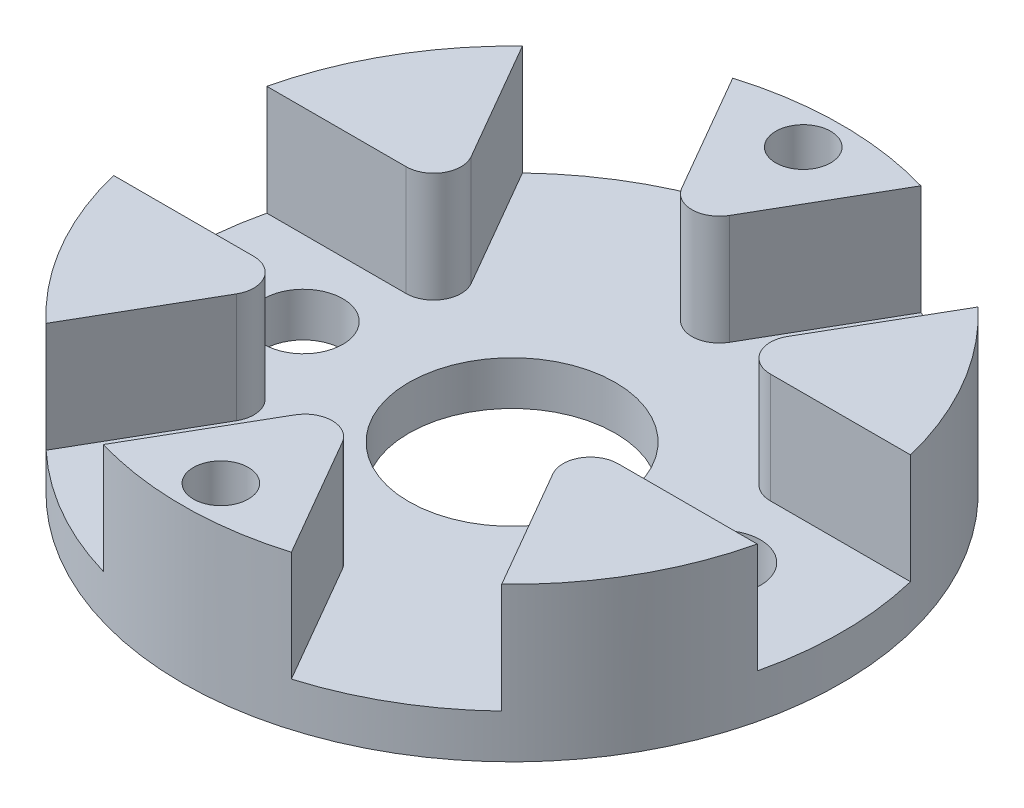
ISO-10303-21;
HEADER;
FILE_DESCRIPTION(('STEP AP214'),'2;1');
FILE_NAME('part.step','',(''),(''),'','','');
FILE_SCHEMA(('AUTOMOTIVE_DESIGN { 1 0 10303 214 1 1 1 1 }'));
ENDSEC;
DATA;
#1=APPLICATION_CONTEXT('core data for automotive mechanical design processes');
#2=APPLICATION_PROTOCOL_DEFINITION('international standard','automotive_design',2000,#1);
#3=PRODUCT_CONTEXT('',#1,'mechanical');
#4=PRODUCT('Part','Part','',(#3));
#5=PRODUCT_RELATED_PRODUCT_CATEGORY('part','',(#4));
#6=PRODUCT_DEFINITION_FORMATION('','',#4);
#7=PRODUCT_DEFINITION_CONTEXT('part definition',#1,'design');
#8=PRODUCT_DEFINITION('design','',#6,#7);
#9=PRODUCT_DEFINITION_SHAPE('','',#8);
#10=(LENGTH_UNIT() NAMED_UNIT(*) SI_UNIT(.MILLI.,.METRE.));
#11=(NAMED_UNIT(*) PLANE_ANGLE_UNIT() SI_UNIT($,.RADIAN.));
#12=(NAMED_UNIT(*) SI_UNIT($,.STERADIAN.) SOLID_ANGLE_UNIT());
#13=UNCERTAINTY_MEASURE_WITH_UNIT(LENGTH_MEASURE(1.E-05),#10,'distance_accuracy_value','');
#14=(GEOMETRIC_REPRESENTATION_CONTEXT(3) GLOBAL_UNCERTAINTY_ASSIGNED_CONTEXT((#13)) GLOBAL_UNIT_ASSIGNED_CONTEXT((#10,
#11,#12)) REPRESENTATION_CONTEXT('',''));
#15=CARTESIAN_POINT('',(0.,0.,0.));
#16=DIRECTION('',(0.,0.,1.));
#17=DIRECTION('',(1.,0.,0.));
#18=AXIS2_PLACEMENT_3D('',#15,#16,#17);
#19=CARTESIAN_POINT('',(0.,2.,0.));
#20=DIRECTION('',(0.,1.,0.));
#21=DIRECTION('',(0.,0.,1.));
#22=AXIS2_PLACEMENT_3D('',#19,#20,#21);
#23=PLANE('',#22);
#24=CARTESIAN_POINT('',(9.5,2.,0.));
#25=DIRECTION('',(0.,1.,0.));
#26=DIRECTION('',(0.,0.,1.));
#27=AXIS2_PLACEMENT_3D('',#24,#25,#26);
#28=CIRCLE('',#27,1.8);
#29=CARTESIAN_POINT('',(9.5,2.,1.8));
#30=VERTEX_POINT('',#29);
#31=EDGE_CURVE('E792',#30,#30,#28,.T.);
#32=ORIENTED_EDGE('',*,*,#31,.F.);
#33=EDGE_LOOP('',(#32));
#34=FACE_BOUND('',#33,.T.);
#35=CARTESIAN_POINT('',(-9.5,2.,0.));
#36=DIRECTION('',(0.,1.,0.));
#37=DIRECTION('',(0.,0.,1.));
#38=AXIS2_PLACEMENT_3D('',#35,#36,#37);
#39=CIRCLE('',#38,1.8);
#40=CARTESIAN_POINT('',(-9.5,2.,1.8));
#41=VERTEX_POINT('',#40);
#42=EDGE_CURVE('E782',#41,#41,#39,.T.);
#43=ORIENTED_EDGE('',*,*,#42,.F.);
#44=EDGE_LOOP('',(#43));
#45=FACE_BOUND('',#44,.T.);
#46=CARTESIAN_POINT('',(0.,2.,0.));
#47=DIRECTION('',(0.,1.,0.));
#48=DIRECTION('',(0.,0.,1.));
#49=AXIS2_PLACEMENT_3D('',#46,#47,#48);
#50=CIRCLE('',#49,4.7);
#51=CARTESIAN_POINT('',(0.,2.,4.7));
#52=VERTEX_POINT('',#51);
#53=EDGE_CURVE('E312',#52,#52,#50,.T.);
#54=ORIENTED_EDGE('',*,*,#53,.F.);
#55=EDGE_LOOP('',(#54));
#56=FACE_BOUND('',#55,.T.);
#57=DIRECTION('',(-0.500234443058651,0.,-0.865890005703843));
#58=VECTOR('',#57,1.);
#59=CARTESIAN_POINT('',(-6.09530314813485,2.,-3.44198772983538));
#60=LINE('',#59,#58);
#61=CARTESIAN_POINT('',(-7.17834248697673,2.,-5.31669458439183));
#62=VERTEX_POINT('',#61);
#63=CARTESIAN_POINT('',(-10.3687672084349,2.,-10.8392189099254));
#64=VERTEX_POINT('',#63);
#65=EDGE_CURVE('E210',#62,#64,#60,.T.);
#66=ORIENTED_EDGE('',*,*,#65,.F.);
#67=CARTESIAN_POINT('',(-8.26070499410654,2.,-4.69140153056852));
#68=DIRECTION('',(0.,1.,0.));
#69=DIRECTION('',(0.,0.,1.));
#70=AXIS2_PLACEMENT_3D('',#67,#68,#69);
#71=CIRCLE('',#70,1.25);
#72=CARTESIAN_POINT('',(-8.2603665782505,2.,-3.44140157637864));
#73=VERTEX_POINT('',#72);
#74=EDGE_CURVE('E331',#62,#73,#71,.F.);
#75=ORIENTED_EDGE('',*,*,#74,.T.);
#76=DIRECTION('',(0.999999963351906,0.,-0.000270732684830262));
#77=VECTOR('',#76,1.);
#78=CARTESIAN_POINT('',(-14.6002933553595,2.,-3.43968515091774));
#79=LINE('',#78,#77);
#80=CARTESIAN_POINT('',(-14.6002933553595,2.,-3.43968515091774));
#81=VERTEX_POINT('',#80);
#82=EDGE_CURVE('E225',#81,#73,#79,.T.);
#83=ORIENTED_EDGE('',*,*,#82,.F.);
#84=CARTESIAN_POINT('',(0.,2.,0.));
#85=DIRECTION('',(0.,1.,0.));
#86=DIRECTION('',(0.,0.,1.));
#87=AXIS2_PLACEMENT_3D('',#84,#85,#86);
#88=CIRCLE('',#87,15.);
#89=CARTESIAN_POINT('',(-14.5714225373935,2.,3.56000635346902));
#90=VERTEX_POINT('',#89);
#91=EDGE_CURVE('E377',#81,#90,#88,.T.);
#92=ORIENTED_EDGE('',*,*,#91,.T.);
#93=DIRECTION('',(-0.999999963351906,0.,0.000270732684829872));
#94=VECTOR('',#93,1.);
#95=CARTESIAN_POINT('',(-6.0285003876192,2.,3.55769350513435));
#96=LINE('',#95,#94);
#97=CARTESIAN_POINT('',(-8.19356381773485,2.,3.5582796585911));
#98=VERTEX_POINT('',#97);
#99=EDGE_CURVE('E234',#98,#90,#96,.T.);
#100=ORIENTED_EDGE('',*,*,#99,.F.);
#101=CARTESIAN_POINT('',(-8.19322540187881,2.,4.80827961278098));
#102=DIRECTION('',(0.,1.,0.));
#103=DIRECTION('',(0.,0.,1.));
#104=AXIS2_PLACEMENT_3D('',#101,#102,#103);
#105=CIRCLE('',#104,1.25);
#106=CARTESIAN_POINT('',(-7.11052447889297,2.,5.43298651314755));
#107=VERTEX_POINT('',#106);
#108=EDGE_CURVE('E329',#98,#107,#105,.F.);
#109=ORIENTED_EDGE('',*,*,#108,.T.);
#110=DIRECTION('',(0.499765520293255,0.,-0.866160738388673));
#111=VECTOR('',#110,1.);
#112=CARTESIAN_POINT('',(-10.2790013993946,2.,10.9243823729876));
#113=LINE('',#112,#111);
#114=CARTESIAN_POINT('',(-10.2790013993946,2.,10.9243823729876));
#115=VERTEX_POINT('',#114);
#116=EDGE_CURVE('E214',#115,#107,#113,.T.);
#117=ORIENTED_EDGE('',*,*,#116,.F.);
#118=CARTESIAN_POINT('',(-4.20265532895859,2.,14.3992252633944));
#119=VERTEX_POINT('',#118);
#120=EDGE_CURVE('E381',#115,#119,#88,.T.);
#121=ORIENTED_EDGE('',*,*,#120,.T.);
#122=DIRECTION('',(-0.499765520293255,0.,0.866160738388674));
#123=VECTOR('',#122,1.);
#124=CARTESIAN_POINT('',(0.0668027605156505,2.,6.99968123496974));
#125=LINE('',#124,#123);
#126=CARTESIAN_POINT('',(-1.01522133075812,2.,8.87497424298294));
#127=VERTEX_POINT('',#126);
#128=EDGE_CURVE('E252',#127,#119,#125,.T.);
#129=ORIENTED_EDGE('',*,*,#128,.F.);
#130=CARTESIAN_POINT('',(0.0674795922277266,2.,9.49968114334951));
#131=DIRECTION('',(0.,1.,0.));
#132=DIRECTION('',(0.,0.,1.));
#133=AXIS2_PLACEMENT_3D('',#130,#131,#132);
#134=CIRCLE('',#133,1.25);
#135=CARTESIAN_POINT('',(1.14984209935753,2.,8.8743880895262));
#136=VERTEX_POINT('',#135);
#137=EDGE_CURVE('E327',#127,#136,#134,.F.);
#138=ORIENTED_EDGE('',*,*,#137,.T.);
#139=DIRECTION('',(-0.50023444305865,0.,-0.865890005703843));
#140=VECTOR('',#139,1.);
#141=CARTESIAN_POINT('',(4.32129195596489,2.,14.3640675239054));
#142=LINE('',#141,#140);
#143=CARTESIAN_POINT('',(4.32129195596488,2.,14.3640675239054));
#144=VERTEX_POINT('',#143);
#145=EDGE_CURVE('E247',#144,#136,#142,.T.);
#146=ORIENTED_EDGE('',*,*,#145,.F.);
#147=CARTESIAN_POINT('',(10.3687672084349,2.,10.8392189099254));
#148=VERTEX_POINT('',#147);
#149=EDGE_CURVE('E398',#144,#148,#88,.T.);
#150=ORIENTED_EDGE('',*,*,#149,.T.);
#151=DIRECTION('',(0.50023444305865,0.,0.865890005703844));
#152=VECTOR('',#151,1.);
#153=CARTESIAN_POINT('',(6.09530314813485,2.,3.44198772983539));
#154=LINE('',#153,#152);
#155=CARTESIAN_POINT('',(7.17834248697673,2.,5.31669458439184));
#156=VERTEX_POINT('',#155);
#157=EDGE_CURVE('E270',#156,#148,#154,.T.);
#158=ORIENTED_EDGE('',*,*,#157,.F.);
#159=CARTESIAN_POINT('',(8.26070499410654,2.,4.69140153056853));
#160=DIRECTION('',(0.,1.,0.));
#161=DIRECTION('',(0.,0.,1.));
#162=AXIS2_PLACEMENT_3D('',#159,#160,#161);
#163=CIRCLE('',#162,1.25);
#164=CARTESIAN_POINT('',(8.2603665782505,2.,3.44140157637864));
#165=VERTEX_POINT('',#164);
#166=EDGE_CURVE('E325',#156,#165,#163,.F.);
#167=ORIENTED_EDGE('',*,*,#166,.T.);
#168=DIRECTION('',(-0.999999963351906,0.,0.000270732684829701));
#169=VECTOR('',#168,1.);
#170=CARTESIAN_POINT('',(14.6002933553595,2.,3.43968515091775));
#171=LINE('',#170,#169);
#172=CARTESIAN_POINT('',(14.6002933553595,2.,3.43968515091775));
#173=VERTEX_POINT('',#172);
#174=EDGE_CURVE('E265',#173,#165,#171,.T.);
#175=ORIENTED_EDGE('',*,*,#174,.F.);
#176=CARTESIAN_POINT('',(14.5714225373935,2.,-3.56000635346901));
#177=VERTEX_POINT('',#176);
#178=EDGE_CURVE('E397',#173,#177,#88,.T.);
#179=ORIENTED_EDGE('',*,*,#178,.T.);
#180=DIRECTION('',(0.999999963351906,0.,-0.000270732684829466));
#181=VECTOR('',#180,1.);
#182=CARTESIAN_POINT('',(6.0285003876192,2.,-3.55769350513435));
#183=LINE('',#182,#181);
#184=CARTESIAN_POINT('',(8.19356381773485,2.,-3.5582796585911));
#185=VERTEX_POINT('',#184);
#186=EDGE_CURVE('E288',#185,#177,#183,.T.);
#187=ORIENTED_EDGE('',*,*,#186,.F.);
#188=CARTESIAN_POINT('',(8.19322540187881,2.,-4.80827961278098));
#189=DIRECTION('',(0.,1.,0.));
#190=DIRECTION('',(0.,0.,1.));
#191=AXIS2_PLACEMENT_3D('',#188,#189,#190);
#192=CIRCLE('',#191,1.25);
#193=CARTESIAN_POINT('',(7.11052447889297,2.,-5.43298651314755));
#194=VERTEX_POINT('',#193);
#195=EDGE_CURVE('E41',#185,#194,#192,.F.);
#196=ORIENTED_EDGE('',*,*,#195,.T.);
#197=DIRECTION('',(-0.499765520293256,0.,0.866160738388673));
#198=VECTOR('',#197,1.);
#199=CARTESIAN_POINT('',(10.2790013993947,2.,-10.9243823729876));
#200=LINE('',#199,#198);
#201=CARTESIAN_POINT('',(10.2790013993947,2.,-10.9243823729876));
#202=VERTEX_POINT('',#201);
#203=EDGE_CURVE('E283',#202,#194,#200,.T.);
#204=ORIENTED_EDGE('',*,*,#203,.F.);
#205=CARTESIAN_POINT('',(4.2026553289586,2.,-14.3992252633944));
#206=VERTEX_POINT('',#205);
#207=EDGE_CURVE('E393',#202,#206,#88,.T.);
#208=ORIENTED_EDGE('',*,*,#207,.T.);
#209=DIRECTION('',(0.499765520293256,0.,-0.866160738388673));
#210=VECTOR('',#209,1.);
#211=CARTESIAN_POINT('',(-0.0668027605156504,2.,-6.99968123496974));
#212=LINE('',#211,#210);
#213=CARTESIAN_POINT('',(1.01522133075812,2.,-8.87497424298293));
#214=VERTEX_POINT('',#213);
#215=EDGE_CURVE('E305',#214,#206,#212,.T.);
#216=ORIENTED_EDGE('',*,*,#215,.F.);
#217=CARTESIAN_POINT('',(-0.0674795922277244,2.,-9.4996811433495));
#218=DIRECTION('',(0.,1.,0.));
#219=DIRECTION('',(0.,0.,1.));
#220=AXIS2_PLACEMENT_3D('',#217,#218,#219);
#221=CIRCLE('',#220,1.25);
#222=CARTESIAN_POINT('',(-1.14984209935753,2.,-8.87438808952619));
#223=VERTEX_POINT('',#222);
#224=EDGE_CURVE('E11',#214,#223,#221,.F.);
#225=ORIENTED_EDGE('',*,*,#224,.T.);
#226=DIRECTION('',(0.50023444305865,0.,0.865890005703844));
#227=VECTOR('',#226,1.);
#228=CARTESIAN_POINT('',(-4.32129195596488,2.,-14.3640675239054));
#229=LINE('',#228,#227);
#230=CARTESIAN_POINT('',(-4.32129195596488,2.,-14.3640675239054));
#231=VERTEX_POINT('',#230);
#232=EDGE_CURVE('E301',#231,#223,#229,.T.);
#233=ORIENTED_EDGE('',*,*,#232,.F.);
#234=EDGE_CURVE('E376',#231,#64,#88,.T.);
#235=ORIENTED_EDGE('',*,*,#234,.T.);
#236=EDGE_LOOP('',(#66,#75,#83,#92,#100,#109,#117,#121,#129,#138,#146,#150,#158,#167,#175,#179,
#187,#196,#204,#208,#216,#225,#233,#235));
#237=FACE_BOUND('',#236,.T.);
#238=ADVANCED_FACE('F33',(#34,#45,#56,#237),#23,.T.);
#239=CARTESIAN_POINT('',(0.,0.,0.));
#240=DIRECTION('',(0.,1.,0.));
#241=DIRECTION('',(0.,0.,1.));
#242=AXIS2_PLACEMENT_3D('',#239,#240,#241);
#243=PLANE('',#242);
#244=CARTESIAN_POINT('',(0.,0.,13.25));
#245=DIRECTION('',(0.,1.,0.));
#246=DIRECTION('',(0.,0.,1.));
#247=AXIS2_PLACEMENT_3D('',#244,#245,#246);
#248=CIRCLE('',#247,1.25);
#249=CARTESIAN_POINT('',(0.,0.,14.5));
#250=VERTEX_POINT('',#249);
#251=EDGE_CURVE('E799',#250,#250,#248,.T.);
#252=ORIENTED_EDGE('',*,*,#251,.T.);
#253=EDGE_LOOP('',(#252));
#254=FACE_BOUND('',#253,.T.);
#255=CARTESIAN_POINT('',(0.,0.,-13.25));
#256=DIRECTION('',(0.,1.,0.));
#257=DIRECTION('',(0.,0.,1.));
#258=AXIS2_PLACEMENT_3D('',#255,#256,#257);
#259=CIRCLE('',#258,1.25);
#260=CARTESIAN_POINT('',(0.,0.,-12.));
#261=VERTEX_POINT('',#260);
#262=EDGE_CURVE('E795',#261,#261,#259,.T.);
#263=ORIENTED_EDGE('',*,*,#262,.T.);
#264=EDGE_LOOP('',(#263));
#265=FACE_BOUND('',#264,.T.);
#266=CARTESIAN_POINT('',(9.5,0.,0.));
#267=DIRECTION('',(0.,1.,0.));
#268=DIRECTION('',(0.,0.,1.));
#269=AXIS2_PLACEMENT_3D('',#266,#267,#268);
#270=CIRCLE('',#269,1.8);
#271=CARTESIAN_POINT('',(9.5,0.,1.8));
#272=VERTEX_POINT('',#271);
#273=EDGE_CURVE('E787',#272,#272,#270,.F.);
#274=ORIENTED_EDGE('',*,*,#273,.F.);
#275=EDGE_LOOP('',(#274));
#276=FACE_BOUND('',#275,.T.);
#277=CARTESIAN_POINT('',(-9.5,0.,0.));
#278=DIRECTION('',(0.,1.,0.));
#279=DIRECTION('',(0.,0.,1.));
#280=AXIS2_PLACEMENT_3D('',#277,#278,#279);
#281=CIRCLE('',#280,1.8);
#282=CARTESIAN_POINT('',(-9.5,0.,1.8));
#283=VERTEX_POINT('',#282);
#284=EDGE_CURVE('E228',#283,#283,#281,.F.);
#285=ORIENTED_EDGE('',*,*,#284,.F.);
#286=EDGE_LOOP('',(#285));
#287=FACE_BOUND('',#286,.T.);
#288=CARTESIAN_POINT('',(0.,0.,0.));
#289=DIRECTION('',(0.,1.,0.));
#290=DIRECTION('',(0.,0.,1.));
#291=AXIS2_PLACEMENT_3D('',#288,#289,#290);
#292=CIRCLE('',#291,15.);
#293=CARTESIAN_POINT('',(0.,0.,15.));
#294=VERTEX_POINT('',#293);
#295=EDGE_CURVE('E386',#294,#294,#292,.T.);
#296=ORIENTED_EDGE('',*,*,#295,.F.);
#297=EDGE_LOOP('',(#296));
#298=FACE_BOUND('',#297,.T.);
#299=CARTESIAN_POINT('',(0.,0.,0.));
#300=DIRECTION('',(0.,1.,0.));
#301=DIRECTION('',(0.,0.,1.));
#302=AXIS2_PLACEMENT_3D('',#299,#300,#301);
#303=CIRCLE('',#302,4.7);
#304=CARTESIAN_POINT('',(0.,0.,4.7));
#305=VERTEX_POINT('',#304);
#306=EDGE_CURVE('E408',#305,#305,#303,.T.);
#307=ORIENTED_EDGE('',*,*,#306,.T.);
#308=EDGE_LOOP('',(#307));
#309=FACE_BOUND('',#308,.T.);
#310=ADVANCED_FACE('F452',(#254,#265,#276,#287,#298,#309),#243,.F.);
#311=CARTESIAN_POINT('',(0.,2.,0.));
#312=DIRECTION('',(0.,-1.,0.));
#313=DIRECTION('',(0.,0.,-1.));
#314=AXIS2_PLACEMENT_3D('',#311,#312,#313);
#315=CYLINDRICAL_SURFACE('',#314,15.);
#316=ORIENTED_EDGE('',*,*,#234,.F.);
#317=DIRECTION('',(0.,-1.,0.));
#318=VECTOR('',#317,1.);
#319=CARTESIAN_POINT('',(-4.32129195596489,7.,-14.3640675239054));
#320=LINE('',#319,#318);
#321=CARTESIAN_POINT('',(-4.32129195596489,7.,-14.3640675239054));
#322=VERTEX_POINT('',#321);
#323=EDGE_CURVE('E309',#322,#231,#320,.T.);
#324=ORIENTED_EDGE('',*,*,#323,.F.);
#325=CARTESIAN_POINT('',(0.,7.,0.));
#326=DIRECTION('',(0.,1.,0.));
#327=DIRECTION('',(0.,0.,-1.));
#328=AXIS2_PLACEMENT_3D('',#325,#326,#327);
#329=CIRCLE('',#328,15.);
#330=CARTESIAN_POINT('',(4.2026553289586,7.,-14.3992252633944));
#331=VERTEX_POINT('',#330);
#332=EDGE_CURVE('E307',#331,#322,#329,.T.);
#333=ORIENTED_EDGE('',*,*,#332,.F.);
#334=DIRECTION('',(0.,-1.,0.));
#335=VECTOR('',#334,1.);
#336=CARTESIAN_POINT('',(4.2026553289586,7.,-14.3992252633944));
#337=LINE('',#336,#335);
#338=EDGE_CURVE('E412',#331,#206,#337,.T.);
#339=ORIENTED_EDGE('',*,*,#338,.T.);
#340=ORIENTED_EDGE('',*,*,#207,.F.);
#341=DIRECTION('',(0.,-1.,0.));
#342=VECTOR('',#341,1.);
#343=CARTESIAN_POINT('',(10.2790013993947,7.,-10.9243823729876));
#344=LINE('',#343,#342);
#345=CARTESIAN_POINT('',(10.2790013993947,7.,-10.9243823729876));
#346=VERTEX_POINT('',#345);
#347=EDGE_CURVE('E292',#346,#202,#344,.T.);
#348=ORIENTED_EDGE('',*,*,#347,.F.);
#349=CARTESIAN_POINT('',(0.,7.,0.));
#350=DIRECTION('',(0.,1.,0.));
#351=DIRECTION('',(0.,0.,-1.));
#352=AXIS2_PLACEMENT_3D('',#349,#350,#351);
#353=CIRCLE('',#352,15.);
#354=CARTESIAN_POINT('',(14.5714225373935,7.,-3.56000635346901));
#355=VERTEX_POINT('',#354);
#356=EDGE_CURVE('E290',#355,#346,#353,.T.);
#357=ORIENTED_EDGE('',*,*,#356,.F.);
#358=DIRECTION('',(0.,-1.,0.));
#359=VECTOR('',#358,1.);
#360=CARTESIAN_POINT('',(14.5714225373935,7.,-3.56000635346901));
#361=LINE('',#360,#359);
#362=EDGE_CURVE('E298',#355,#177,#361,.T.);
#363=ORIENTED_EDGE('',*,*,#362,.T.);
#364=ORIENTED_EDGE('',*,*,#178,.F.);
#365=DIRECTION('',(0.,-1.,0.));
#366=VECTOR('',#365,1.);
#367=CARTESIAN_POINT('',(14.6002933553595,7.,3.43968515091775));
#368=LINE('',#367,#366);
#369=CARTESIAN_POINT('',(14.6002933553595,7.,3.43968515091775));
#370=VERTEX_POINT('',#369);
#371=EDGE_CURVE('E274',#370,#173,#368,.T.);
#372=ORIENTED_EDGE('',*,*,#371,.F.);
#373=CARTESIAN_POINT('',(0.,7.,0.));
#374=DIRECTION('',(0.,1.,0.));
#375=DIRECTION('',(0.,0.,-1.));
#376=AXIS2_PLACEMENT_3D('',#373,#374,#375);
#377=CIRCLE('',#376,15.);
#378=CARTESIAN_POINT('',(10.3687672084349,7.,10.8392189099254));
#379=VERTEX_POINT('',#378);
#380=EDGE_CURVE('E272',#379,#370,#377,.T.);
#381=ORIENTED_EDGE('',*,*,#380,.F.);
#382=DIRECTION('',(0.,-1.,0.));
#383=VECTOR('',#382,1.);
#384=CARTESIAN_POINT('',(10.3687672084349,7.,10.8392189099254));
#385=LINE('',#384,#383);
#386=EDGE_CURVE('E280',#379,#148,#385,.T.);
#387=ORIENTED_EDGE('',*,*,#386,.T.);
#388=ORIENTED_EDGE('',*,*,#149,.F.);
#389=DIRECTION('',(0.,-1.,0.));
#390=VECTOR('',#389,1.);
#391=CARTESIAN_POINT('',(4.32129195596488,7.,14.3640675239054));
#392=LINE('',#391,#390);
#393=CARTESIAN_POINT('',(4.32129195596488,7.,14.3640675239054));
#394=VERTEX_POINT('',#393);
#395=EDGE_CURVE('E256',#394,#144,#392,.T.);
#396=ORIENTED_EDGE('',*,*,#395,.F.);
#397=CARTESIAN_POINT('',(0.,7.,0.));
#398=DIRECTION('',(0.,1.,0.));
#399=DIRECTION('',(0.,0.,-1.));
#400=AXIS2_PLACEMENT_3D('',#397,#398,#399);
#401=CIRCLE('',#400,15.);
#402=CARTESIAN_POINT('',(-4.20265532895859,7.,14.3992252633944));
#403=VERTEX_POINT('',#402);
#404=EDGE_CURVE('E254',#403,#394,#401,.T.);
#405=ORIENTED_EDGE('',*,*,#404,.F.);
#406=DIRECTION('',(0.,-1.,0.));
#407=VECTOR('',#406,1.);
#408=CARTESIAN_POINT('',(-4.20265532895859,7.,14.3992252633944));
#409=LINE('',#408,#407);
#410=EDGE_CURVE('E262',#403,#119,#409,.T.);
#411=ORIENTED_EDGE('',*,*,#410,.T.);
#412=ORIENTED_EDGE('',*,*,#120,.F.);
#413=DIRECTION('',(0.,-1.,0.));
#414=VECTOR('',#413,1.);
#415=CARTESIAN_POINT('',(-10.2790013993946,7.,10.9243823729876));
#416=LINE('',#415,#414);
#417=CARTESIAN_POINT('',(-10.2790013993946,7.,10.9243823729876));
#418=VERTEX_POINT('',#417);
#419=EDGE_CURVE('E238',#418,#115,#416,.T.);
#420=ORIENTED_EDGE('',*,*,#419,.F.);
#421=CARTESIAN_POINT('',(0.,7.,0.));
#422=DIRECTION('',(0.,1.,0.));
#423=DIRECTION('',(0.,0.,-1.));
#424=AXIS2_PLACEMENT_3D('',#421,#422,#423);
#425=CIRCLE('',#424,15.);
#426=CARTESIAN_POINT('',(-14.5714225373935,7.,3.56000635346902));
#427=VERTEX_POINT('',#426);
#428=EDGE_CURVE('E236',#427,#418,#425,.T.);
#429=ORIENTED_EDGE('',*,*,#428,.F.);
#430=DIRECTION('',(0.,-1.,0.));
#431=VECTOR('',#430,1.);
#432=CARTESIAN_POINT('',(-14.5714225373935,7.,3.56000635346902));
#433=LINE('',#432,#431);
#434=EDGE_CURVE('E244',#427,#90,#433,.T.);
#435=ORIENTED_EDGE('',*,*,#434,.T.);
#436=ORIENTED_EDGE('',*,*,#91,.F.);
#437=DIRECTION('',(0.,-1.,0.));
#438=VECTOR('',#437,1.);
#439=CARTESIAN_POINT('',(-14.6002933553595,7.,-3.43968515091774));
#440=LINE('',#439,#438);
#441=CARTESIAN_POINT('',(-14.6002933553595,7.,-3.43968515091774));
#442=VERTEX_POINT('',#441);
#443=EDGE_CURVE('E215',#442,#81,#440,.T.);
#444=ORIENTED_EDGE('',*,*,#443,.F.);
#445=CARTESIAN_POINT('',(0.,7.,0.));
#446=DIRECTION('',(0.,1.,0.));
#447=DIRECTION('',(0.,0.,-1.));
#448=AXIS2_PLACEMENT_3D('',#445,#446,#447);
#449=CIRCLE('',#448,15.);
#450=CARTESIAN_POINT('',(-10.3687672084349,7.,-10.8392189099254));
#451=VERTEX_POINT('',#450);
#452=EDGE_CURVE('E197',#451,#442,#449,.T.);
#453=ORIENTED_EDGE('',*,*,#452,.F.);
#454=DIRECTION('',(0.,-1.,0.));
#455=VECTOR('',#454,1.);
#456=CARTESIAN_POINT('',(-10.3687672084349,7.,-10.8392189099254));
#457=LINE('',#456,#455);
#458=EDGE_CURVE('E207',#451,#64,#457,.T.);
#459=ORIENTED_EDGE('',*,*,#458,.T.);
#460=EDGE_LOOP('',(#316,#324,#333,#339,#340,#348,#357,#363,#364,#372,#381,#387,#388,#396,#405,
#411,#412,#420,#429,#435,#436,#444,#453,#459));
#461=FACE_BOUND('',#460,.T.);
#462=ORIENTED_EDGE('',*,*,#295,.T.);
#463=EDGE_LOOP('',(#462));
#464=FACE_BOUND('',#463,.T.);
#465=ADVANCED_FACE('F217',(#461,#464),#315,.T.);
#466=CARTESIAN_POINT('',(0.,2.,0.));
#467=DIRECTION('',(0.,-1.,0.));
#468=DIRECTION('',(0.,0.,-1.));
#469=AXIS2_PLACEMENT_3D('',#466,#467,#468);
#470=CYLINDRICAL_SURFACE('',#469,4.7);
#471=ORIENTED_EDGE('',*,*,#53,.T.);
#472=EDGE_LOOP('',(#471));
#473=FACE_BOUND('',#472,.T.);
#474=ORIENTED_EDGE('',*,*,#306,.F.);
#475=EDGE_LOOP('',(#474));
#476=FACE_BOUND('',#475,.T.);
#477=ADVANCED_FACE('F463',(#473,#476),#470,.F.);
#478=CARTESIAN_POINT('',(-4.32129195596488,7.,-14.3640675239054));
#479=DIRECTION('',(0.865890005703844,0.,-0.50023444305865));
#480=DIRECTION('',(-0.50023444305865,0.,-0.865890005703844));
#481=AXIS2_PLACEMENT_3D('',#478,#479,#480);
#482=PLANE('',#481);
#483=ORIENTED_EDGE('',*,*,#232,.T.);
#484=DIRECTION('',(0.,-1.,0.));
#485=VECTOR('',#484,1.);
#486=CARTESIAN_POINT('',(-1.14984209935753,7.,-8.87438808952619));
#487=LINE('',#486,#485);
#488=CARTESIAN_POINT('',(-1.14984209935753,7.,-8.87438808952619));
#489=VERTEX_POINT('',#488);
#490=EDGE_CURVE('E48',#223,#489,#487,.F.);
#491=ORIENTED_EDGE('',*,*,#490,.T.);
#492=DIRECTION('',(0.50023444305865,0.,0.865890005703844));
#493=VECTOR('',#492,1.);
#494=CARTESIAN_POINT('',(-4.32129195596488,7.,-14.3640675239054));
#495=LINE('',#494,#493);
#496=EDGE_CURVE('E302',#322,#489,#495,.T.);
#497=ORIENTED_EDGE('',*,*,#496,.F.);
#498=ORIENTED_EDGE('',*,*,#323,.T.);
#499=EDGE_LOOP('',(#483,#491,#497,#498));
#500=FACE_BOUND('',#499,.T.);
#501=ADVANCED_FACE('F425',(#500),#482,.F.);
#502=CARTESIAN_POINT('',(-0.0668027605156504,7.,-6.99968123496974));
#503=DIRECTION('',(-0.866160738388673,0.,-0.499765520293256));
#504=DIRECTION('',(-0.499765520293256,0.,0.866160738388673));
#505=AXIS2_PLACEMENT_3D('',#502,#503,#504);
#506=PLANE('',#505);
#507=DIRECTION('',(0.499765520293256,0.,-0.866160738388673));
#508=VECTOR('',#507,1.);
#509=CARTESIAN_POINT('',(-0.0668027605156504,7.,-6.99968123496974));
#510=LINE('',#509,#508);
#511=CARTESIAN_POINT('',(1.01522133075812,7.,-8.87497424298293));
#512=VERTEX_POINT('',#511);
#513=EDGE_CURVE('E304',#512,#331,#510,.T.);
#514=ORIENTED_EDGE('',*,*,#513,.F.);
#515=DIRECTION('',(0.,-1.,0.));
#516=VECTOR('',#515,1.);
#517=CARTESIAN_POINT('',(1.01522133075812,7.,-8.87497424298293));
#518=LINE('',#517,#516);
#519=EDGE_CURVE('E319',#512,#214,#518,.T.);
#520=ORIENTED_EDGE('',*,*,#519,.T.);
#521=ORIENTED_EDGE('',*,*,#215,.T.);
#522=ORIENTED_EDGE('',*,*,#338,.F.);
#523=EDGE_LOOP('',(#514,#520,#521,#522));
#524=FACE_BOUND('',#523,.T.);
#525=ADVANCED_FACE('F434',(#524),#506,.F.);
#526=CARTESIAN_POINT('',(0.,7.,0.));
#527=DIRECTION('',(0.,-1.,0.));
#528=DIRECTION('',(0.,0.,-1.));
#529=AXIS2_PLACEMENT_3D('',#526,#527,#528);
#530=PLANE('',#529);
#531=CARTESIAN_POINT('',(0.,7.,-13.25));
#532=DIRECTION('',(0.,1.,0.));
#533=DIRECTION('',(0.,0.,1.));
#534=AXIS2_PLACEMENT_3D('',#531,#532,#533);
#535=CIRCLE('',#534,1.25);
#536=CARTESIAN_POINT('',(0.,7.,-12.));
#537=VERTEX_POINT('',#536);
#538=EDGE_CURVE('E796',#537,#537,#535,.T.);
#539=ORIENTED_EDGE('',*,*,#538,.F.);
#540=EDGE_LOOP('',(#539));
#541=FACE_BOUND('',#540,.T.);
#542=ORIENTED_EDGE('',*,*,#496,.T.);
#543=CARTESIAN_POINT('',(-0.0674795922277244,7.,-9.4996811433495));
#544=DIRECTION('',(0.,-1.,0.));
#545=DIRECTION('',(0.,0.,-1.));
#546=AXIS2_PLACEMENT_3D('',#543,#544,#545);
#547=CIRCLE('',#546,1.25);
#548=EDGE_CURVE('E323',#489,#512,#547,.F.);
#549=ORIENTED_EDGE('',*,*,#548,.T.);
#550=ORIENTED_EDGE('',*,*,#513,.T.);
#551=ORIENTED_EDGE('',*,*,#332,.T.);
#552=EDGE_LOOP('',(#542,#549,#550,#551));
#553=FACE_BOUND('',#552,.T.);
#554=ADVANCED_FACE('F432',(#541,#553),#530,.F.);
#555=CARTESIAN_POINT('',(10.2790013993947,7.,-10.9243823729876));
#556=DIRECTION('',(0.866160738388673,0.,0.499765520293256));
#557=DIRECTION('',(0.499765520293256,0.,-0.866160738388673));
#558=AXIS2_PLACEMENT_3D('',#555,#556,#557);
#559=PLANE('',#558);
#560=ORIENTED_EDGE('',*,*,#203,.T.);
#561=DIRECTION('',(0.,-1.,0.));
#562=VECTOR('',#561,1.);
#563=CARTESIAN_POINT('',(7.11052447889297,7.,-5.43298651314755));
#564=LINE('',#563,#562);
#565=CARTESIAN_POINT('',(7.11052447889297,7.,-5.43298651314755));
#566=VERTEX_POINT('',#565);
#567=EDGE_CURVE('E343',#194,#566,#564,.F.);
#568=ORIENTED_EDGE('',*,*,#567,.T.);
#569=DIRECTION('',(-0.499765520293256,0.,0.866160738388673));
#570=VECTOR('',#569,1.);
#571=CARTESIAN_POINT('',(10.2790013993947,7.,-10.9243823729876));
#572=LINE('',#571,#570);
#573=EDGE_CURVE('E284',#346,#566,#572,.T.);
#574=ORIENTED_EDGE('',*,*,#573,.F.);
#575=ORIENTED_EDGE('',*,*,#347,.T.);
#576=EDGE_LOOP('',(#560,#568,#574,#575));
#577=FACE_BOUND('',#576,.T.);
#578=ADVANCED_FACE('F341',(#577),#559,.F.);
#579=CARTESIAN_POINT('',(6.0285003876192,7.,-3.55769350513435));
#580=DIRECTION('',(-0.000270732684829466,0.,-0.999999963351906));
#581=DIRECTION('',(-0.999999963351906,0.,0.000270732684829466));
#582=AXIS2_PLACEMENT_3D('',#579,#580,#581);
#583=PLANE('',#582);
#584=DIRECTION('',(0.999999963351906,0.,-0.000270732684829466));
#585=VECTOR('',#584,1.);
#586=CARTESIAN_POINT('',(6.0285003876192,7.,-3.55769350513435));
#587=LINE('',#586,#585);
#588=CARTESIAN_POINT('',(8.19356381773485,7.,-3.5582796585911));
#589=VERTEX_POINT('',#588);
#590=EDGE_CURVE('E287',#589,#355,#587,.T.);
#591=ORIENTED_EDGE('',*,*,#590,.F.);
#592=DIRECTION('',(0.,-1.,0.));
#593=VECTOR('',#592,1.);
#594=CARTESIAN_POINT('',(8.19356381773485,7.,-3.5582796585911));
#595=LINE('',#594,#593);
#596=EDGE_CURVE('E347',#589,#185,#595,.T.);
#597=ORIENTED_EDGE('',*,*,#596,.T.);
#598=ORIENTED_EDGE('',*,*,#186,.T.);
#599=ORIENTED_EDGE('',*,*,#362,.F.);
#600=EDGE_LOOP('',(#591,#597,#598,#599));
#601=FACE_BOUND('',#600,.T.);
#602=ADVANCED_FACE('F539',(#601),#583,.F.);
#603=CARTESIAN_POINT('',(0.,7.,0.));
#604=DIRECTION('',(0.,-1.,0.));
#605=DIRECTION('',(0.,0.,-1.));
#606=AXIS2_PLACEMENT_3D('',#603,#604,#605);
#607=PLANE('',#606);
#608=ORIENTED_EDGE('',*,*,#573,.T.);
#609=CARTESIAN_POINT('',(8.19322540187881,7.,-4.80827961278098));
#610=DIRECTION('',(0.,-1.,0.));
#611=DIRECTION('',(0.,0.,-1.));
#612=AXIS2_PLACEMENT_3D('',#609,#610,#611);
#613=CIRCLE('',#612,1.25);
#614=EDGE_CURVE('E317',#566,#589,#613,.F.);
#615=ORIENTED_EDGE('',*,*,#614,.T.);
#616=ORIENTED_EDGE('',*,*,#590,.T.);
#617=ORIENTED_EDGE('',*,*,#356,.T.);
#618=EDGE_LOOP('',(#608,#615,#616,#617));
#619=FACE_BOUND('',#618,.T.);
#620=ADVANCED_FACE('F535',(#619),#607,.F.);
#621=CARTESIAN_POINT('',(14.6002933553595,7.,3.43968515091775));
#622=DIRECTION('',(0.000270732684829701,0.,0.999999963351906));
#623=DIRECTION('',(0.999999963351906,0.,-0.000270732684829701));
#624=AXIS2_PLACEMENT_3D('',#621,#622,#623);
#625=PLANE('',#624);
#626=ORIENTED_EDGE('',*,*,#174,.T.);
#627=DIRECTION('',(0.,-1.,0.));
#628=VECTOR('',#627,1.);
#629=CARTESIAN_POINT('',(8.2603665782505,7.,3.44140157637864));
#630=LINE('',#629,#628);
#631=CARTESIAN_POINT('',(8.2603665782505,7.,3.44140157637864));
#632=VERTEX_POINT('',#631);
#633=EDGE_CURVE('E371',#165,#632,#630,.F.);
#634=ORIENTED_EDGE('',*,*,#633,.T.);
#635=DIRECTION('',(-0.999999963351906,0.,0.000270732684829701));
#636=VECTOR('',#635,1.);
#637=CARTESIAN_POINT('',(14.6002933553595,7.,3.43968515091775));
#638=LINE('',#637,#636);
#639=EDGE_CURVE('E266',#370,#632,#638,.T.);
#640=ORIENTED_EDGE('',*,*,#639,.F.);
#641=ORIENTED_EDGE('',*,*,#371,.T.);
#642=EDGE_LOOP('',(#626,#634,#640,#641));
#643=FACE_BOUND('',#642,.T.);
#644=ADVANCED_FACE('F531',(#643),#625,.F.);
#645=CARTESIAN_POINT('',(6.09530314813485,7.,3.44198772983539));
#646=DIRECTION('',(0.865890005703844,0.,-0.50023444305865));
#647=DIRECTION('',(-0.50023444305865,0.,-0.865890005703844));
#648=AXIS2_PLACEMENT_3D('',#645,#646,#647);
#649=PLANE('',#648);
#650=DIRECTION('',(0.50023444305865,0.,0.865890005703844));
#651=VECTOR('',#650,1.);
#652=CARTESIAN_POINT('',(6.09530314813485,7.,3.44198772983539));
#653=LINE('',#652,#651);
#654=CARTESIAN_POINT('',(7.17834248697673,7.,5.31669458439184));
#655=VERTEX_POINT('',#654);
#656=EDGE_CURVE('E269',#655,#379,#653,.T.);
#657=ORIENTED_EDGE('',*,*,#656,.F.);
#658=DIRECTION('',(0.,-1.,0.));
#659=VECTOR('',#658,1.);
#660=CARTESIAN_POINT('',(7.17834248697673,7.,5.31669458439184));
#661=LINE('',#660,#659);
#662=EDGE_CURVE('E373',#655,#156,#661,.T.);
#663=ORIENTED_EDGE('',*,*,#662,.T.);
#664=ORIENTED_EDGE('',*,*,#157,.T.);
#665=ORIENTED_EDGE('',*,*,#386,.F.);
#666=EDGE_LOOP('',(#657,#663,#664,#665));
#667=FACE_BOUND('',#666,.T.);
#668=ADVANCED_FACE('F527',(#667),#649,.F.);
#669=CARTESIAN_POINT('',(0.,7.,0.));
#670=DIRECTION('',(0.,-1.,0.));
#671=DIRECTION('',(0.,0.,-1.));
#672=AXIS2_PLACEMENT_3D('',#669,#670,#671);
#673=PLANE('',#672);
#674=ORIENTED_EDGE('',*,*,#639,.T.);
#675=CARTESIAN_POINT('',(8.26070499410654,7.,4.69140153056853));
#676=DIRECTION('',(0.,-1.,0.));
#677=DIRECTION('',(0.,0.,-1.));
#678=AXIS2_PLACEMENT_3D('',#675,#676,#677);
#679=CIRCLE('',#678,1.25);
#680=EDGE_CURVE('E369',#632,#655,#679,.F.);
#681=ORIENTED_EDGE('',*,*,#680,.T.);
#682=ORIENTED_EDGE('',*,*,#656,.T.);
#683=ORIENTED_EDGE('',*,*,#380,.T.);
#684=EDGE_LOOP('',(#674,#681,#682,#683));
#685=FACE_BOUND('',#684,.T.);
#686=ADVANCED_FACE('F524',(#685),#673,.F.);
#687=CARTESIAN_POINT('',(4.32129195596489,7.,14.3640675239054));
#688=DIRECTION('',(-0.865890005703843,0.,0.50023444305865));
#689=DIRECTION('',(0.50023444305865,0.,0.865890005703843));
#690=AXIS2_PLACEMENT_3D('',#687,#688,#689);
#691=PLANE('',#690);
#692=ORIENTED_EDGE('',*,*,#145,.T.);
#693=DIRECTION('',(0.,-1.,0.));
#694=VECTOR('',#693,1.);
#695=CARTESIAN_POINT('',(1.14984209935753,7.,8.8743880895262));
#696=LINE('',#695,#694);
#697=CARTESIAN_POINT('',(1.14984209935753,7.,8.8743880895262));
#698=VERTEX_POINT('',#697);
#699=EDGE_CURVE('E364',#136,#698,#696,.F.);
#700=ORIENTED_EDGE('',*,*,#699,.T.);
#701=DIRECTION('',(-0.50023444305865,0.,-0.865890005703843));
#702=VECTOR('',#701,1.);
#703=CARTESIAN_POINT('',(4.32129195596489,7.,14.3640675239054));
#704=LINE('',#703,#702);
#705=EDGE_CURVE('E248',#394,#698,#704,.T.);
#706=ORIENTED_EDGE('',*,*,#705,.F.);
#707=ORIENTED_EDGE('',*,*,#395,.T.);
#708=EDGE_LOOP('',(#692,#700,#706,#707));
#709=FACE_BOUND('',#708,.T.);
#710=ADVANCED_FACE('F490',(#709),#691,.F.);
#711=CARTESIAN_POINT('',(0.0668027605156505,7.,6.99968123496974));
#712=DIRECTION('',(0.866160738388674,0.,0.499765520293255));
#713=DIRECTION('',(0.499765520293255,0.,-0.866160738388674));
#714=AXIS2_PLACEMENT_3D('',#711,#712,#713);
#715=PLANE('',#714);
#716=DIRECTION('',(-0.499765520293255,0.,0.866160738388674));
#717=VECTOR('',#716,1.);
#718=CARTESIAN_POINT('',(0.0668027605156505,7.,6.99968123496974));
#719=LINE('',#718,#717);
#720=CARTESIAN_POINT('',(-1.01522133075812,7.,8.87497424298294));
#721=VERTEX_POINT('',#720);
#722=EDGE_CURVE('E251',#721,#403,#719,.T.);
#723=ORIENTED_EDGE('',*,*,#722,.F.);
#724=DIRECTION('',(0.,-1.,0.));
#725=VECTOR('',#724,1.);
#726=CARTESIAN_POINT('',(-1.01522133075812,7.,8.87497424298294));
#727=LINE('',#726,#725);
#728=EDGE_CURVE('E366',#721,#127,#727,.T.);
#729=ORIENTED_EDGE('',*,*,#728,.T.);
#730=ORIENTED_EDGE('',*,*,#128,.T.);
#731=ORIENTED_EDGE('',*,*,#410,.F.);
#732=EDGE_LOOP('',(#723,#729,#730,#731));
#733=FACE_BOUND('',#732,.T.);
#734=ADVANCED_FACE('F485',(#733),#715,.F.);
#735=CARTESIAN_POINT('',(0.,7.,0.));
#736=DIRECTION('',(0.,-1.,0.));
#737=DIRECTION('',(0.,0.,-1.));
#738=AXIS2_PLACEMENT_3D('',#735,#736,#737);
#739=PLANE('',#738);
#740=CARTESIAN_POINT('',(0.,7.,13.25));
#741=DIRECTION('',(0.,1.,0.));
#742=DIRECTION('',(0.,0.,1.));
#743=AXIS2_PLACEMENT_3D('',#740,#741,#742);
#744=CIRCLE('',#743,1.25);
#745=CARTESIAN_POINT('',(0.,7.,14.5));
#746=VERTEX_POINT('',#745);
#747=EDGE_CURVE('E802',#746,#746,#744,.T.);
#748=ORIENTED_EDGE('',*,*,#747,.F.);
#749=EDGE_LOOP('',(#748));
#750=FACE_BOUND('',#749,.T.);
#751=ORIENTED_EDGE('',*,*,#705,.T.);
#752=CARTESIAN_POINT('',(0.0674795922277266,7.,9.49968114334951));
#753=DIRECTION('',(0.,-1.,0.));
#754=DIRECTION('',(0.,0.,-1.));
#755=AXIS2_PLACEMENT_3D('',#752,#753,#754);
#756=CIRCLE('',#755,1.25);
#757=EDGE_CURVE('E362',#698,#721,#756,.F.);
#758=ORIENTED_EDGE('',*,*,#757,.T.);
#759=ORIENTED_EDGE('',*,*,#722,.T.);
#760=ORIENTED_EDGE('',*,*,#404,.T.);
#761=EDGE_LOOP('',(#751,#758,#759,#760));
#762=FACE_BOUND('',#761,.T.);
#763=ADVANCED_FACE('F481',(#750,#762),#739,.F.);
#764=CARTESIAN_POINT('',(-10.2790013993946,7.,10.9243823729876));
#765=DIRECTION('',(-0.866160738388673,0.,-0.499765520293255));
#766=DIRECTION('',(-0.499765520293255,0.,0.866160738388673));
#767=AXIS2_PLACEMENT_3D('',#764,#765,#766);
#768=PLANE('',#767);
#769=ORIENTED_EDGE('',*,*,#116,.T.);
#770=DIRECTION('',(0.,-1.,0.));
#771=VECTOR('',#770,1.);
#772=CARTESIAN_POINT('',(-7.11052447889297,7.,5.43298651314755));
#773=LINE('',#772,#771);
#774=CARTESIAN_POINT('',(-7.11052447889297,7.,5.43298651314755));
#775=VERTEX_POINT('',#774);
#776=EDGE_CURVE('E357',#107,#775,#773,.F.);
#777=ORIENTED_EDGE('',*,*,#776,.T.);
#778=DIRECTION('',(0.499765520293255,0.,-0.866160738388673));
#779=VECTOR('',#778,1.);
#780=CARTESIAN_POINT('',(-10.2790013993946,7.,10.9243823729876));
#781=LINE('',#780,#779);
#782=EDGE_CURVE('E230',#418,#775,#781,.T.);
#783=ORIENTED_EDGE('',*,*,#782,.F.);
#784=ORIENTED_EDGE('',*,*,#419,.T.);
#785=EDGE_LOOP('',(#769,#777,#783,#784));
#786=FACE_BOUND('',#785,.T.);
#787=ADVANCED_FACE('F496',(#786),#768,.F.);
#788=CARTESIAN_POINT('',(-6.0285003876192,7.,3.55769350513435));
#789=DIRECTION('',(0.000270732684829872,0.,0.999999963351906));
#790=DIRECTION('',(0.999999963351906,0.,-0.000270732684829872));
#791=AXIS2_PLACEMENT_3D('',#788,#789,#790);
#792=PLANE('',#791);
#793=DIRECTION('',(-0.999999963351906,0.,0.000270732684829872));
#794=VECTOR('',#793,1.);
#795=CARTESIAN_POINT('',(-6.0285003876192,7.,3.55769350513435));
#796=LINE('',#795,#794);
#797=CARTESIAN_POINT('',(-8.19356381773485,7.,3.5582796585911));
#798=VERTEX_POINT('',#797);
#799=EDGE_CURVE('E233',#798,#427,#796,.T.);
#800=ORIENTED_EDGE('',*,*,#799,.F.);
#801=DIRECTION('',(0.,-1.,0.));
#802=VECTOR('',#801,1.);
#803=CARTESIAN_POINT('',(-8.19356381773485,7.,3.5582796585911));
#804=LINE('',#803,#802);
#805=EDGE_CURVE('E359',#798,#98,#804,.T.);
#806=ORIENTED_EDGE('',*,*,#805,.T.);
#807=ORIENTED_EDGE('',*,*,#99,.T.);
#808=ORIENTED_EDGE('',*,*,#434,.F.);
#809=EDGE_LOOP('',(#800,#806,#807,#808));
#810=FACE_BOUND('',#809,.T.);
#811=ADVANCED_FACE('F505',(#810),#792,.F.);
#812=CARTESIAN_POINT('',(0.,7.,0.));
#813=DIRECTION('',(0.,-1.,0.));
#814=DIRECTION('',(0.,0.,-1.));
#815=AXIS2_PLACEMENT_3D('',#812,#813,#814);
#816=PLANE('',#815);
#817=ORIENTED_EDGE('',*,*,#782,.T.);
#818=CARTESIAN_POINT('',(-8.19322540187881,7.,4.80827961278098));
#819=DIRECTION('',(0.,-1.,0.));
#820=DIRECTION('',(0.,0.,-1.));
#821=AXIS2_PLACEMENT_3D('',#818,#819,#820);
#822=CIRCLE('',#821,1.25);
#823=EDGE_CURVE('E355',#775,#798,#822,.F.);
#824=ORIENTED_EDGE('',*,*,#823,.T.);
#825=ORIENTED_EDGE('',*,*,#799,.T.);
#826=ORIENTED_EDGE('',*,*,#428,.T.);
#827=EDGE_LOOP('',(#817,#824,#825,#826));
#828=FACE_BOUND('',#827,.T.);
#829=ADVANCED_FACE('F500',(#828),#816,.F.);
#830=CARTESIAN_POINT('',(-14.6002933553595,7.,-3.43968515091774));
#831=DIRECTION('',(-0.000270732684830262,0.,-0.999999963351906));
#832=DIRECTION('',(-0.999999963351906,0.,0.000270732684830262));
#833=AXIS2_PLACEMENT_3D('',#830,#831,#832);
#834=PLANE('',#833);
#835=ORIENTED_EDGE('',*,*,#82,.T.);
#836=DIRECTION('',(0.,-1.,0.));
#837=VECTOR('',#836,1.);
#838=CARTESIAN_POINT('',(-8.2603665782505,7.,-3.44140157637864));
#839=LINE('',#838,#837);
#840=CARTESIAN_POINT('',(-8.2603665782505,7.,-3.44140157637864));
#841=VERTEX_POINT('',#840);
#842=EDGE_CURVE('E351',#73,#841,#839,.F.);
#843=ORIENTED_EDGE('',*,*,#842,.T.);
#844=DIRECTION('',(0.999999963351906,0.,-0.000270732684830262));
#845=VECTOR('',#844,1.);
#846=CARTESIAN_POINT('',(-14.6002933553595,7.,-3.43968515091774));
#847=LINE('',#846,#845);
#848=EDGE_CURVE('E204',#442,#841,#847,.T.);
#849=ORIENTED_EDGE('',*,*,#848,.F.);
#850=ORIENTED_EDGE('',*,*,#443,.T.);
#851=EDGE_LOOP('',(#835,#843,#849,#850));
#852=FACE_BOUND('',#851,.T.);
#853=ADVANCED_FACE('F439',(#852),#834,.F.);
#854=CARTESIAN_POINT('',(-6.09530314813485,7.,-3.44198772983538));
#855=DIRECTION('',(-0.865890005703843,0.,0.500234443058651));
#856=DIRECTION('',(0.500234443058651,0.,0.865890005703843));
#857=AXIS2_PLACEMENT_3D('',#854,#855,#856);
#858=PLANE('',#857);
#859=DIRECTION('',(-0.500234443058651,0.,-0.865890005703843));
#860=VECTOR('',#859,1.);
#861=CARTESIAN_POINT('',(-6.09530314813485,7.,-3.44198772983538));
#862=LINE('',#861,#860);
#863=CARTESIAN_POINT('',(-7.17834248697673,7.,-5.31669458439183));
#864=VERTEX_POINT('',#863);
#865=EDGE_CURVE('E192',#864,#451,#862,.T.);
#866=ORIENTED_EDGE('',*,*,#865,.F.);
#867=DIRECTION('',(0.,-1.,0.));
#868=VECTOR('',#867,1.);
#869=CARTESIAN_POINT('',(-7.17834248697673,7.,-5.31669458439183));
#870=LINE('',#869,#868);
#871=EDGE_CURVE('E353',#864,#62,#870,.T.);
#872=ORIENTED_EDGE('',*,*,#871,.T.);
#873=ORIENTED_EDGE('',*,*,#65,.T.);
#874=ORIENTED_EDGE('',*,*,#458,.F.);
#875=EDGE_LOOP('',(#866,#872,#873,#874));
#876=FACE_BOUND('',#875,.T.);
#877=ADVANCED_FACE('F208',(#876),#858,.F.);
#878=CARTESIAN_POINT('',(0.,7.,0.));
#879=DIRECTION('',(0.,-1.,0.));
#880=DIRECTION('',(0.,0.,-1.));
#881=AXIS2_PLACEMENT_3D('',#878,#879,#880);
#882=PLANE('',#881);
#883=ORIENTED_EDGE('',*,*,#848,.T.);
#884=CARTESIAN_POINT('',(-8.26070499410654,7.,-4.69140153056852));
#885=DIRECTION('',(0.,-1.,0.));
#886=DIRECTION('',(0.,0.,-1.));
#887=AXIS2_PLACEMENT_3D('',#884,#885,#886);
#888=CIRCLE('',#887,1.25);
#889=EDGE_CURVE('E200',#841,#864,#888,.F.);
#890=ORIENTED_EDGE('',*,*,#889,.T.);
#891=ORIENTED_EDGE('',*,*,#865,.T.);
#892=ORIENTED_EDGE('',*,*,#452,.T.);
#893=EDGE_LOOP('',(#883,#890,#891,#892));
#894=FACE_BOUND('',#893,.T.);
#895=ADVANCED_FACE('F195',(#894),#882,.F.);
#896=CARTESIAN_POINT('',(8.26070499410654,7.,4.69140153056853));
#897=DIRECTION('',(0.,-1.,0.));
#898=DIRECTION('',(0.,0.,-1.));
#899=AXIS2_PLACEMENT_3D('',#896,#897,#898);
#900=CYLINDRICAL_SURFACE('',#899,1.25);
#901=ORIENTED_EDGE('',*,*,#680,.F.);
#902=ORIENTED_EDGE('',*,*,#633,.F.);
#903=ORIENTED_EDGE('',*,*,#166,.F.);
#904=ORIENTED_EDGE('',*,*,#662,.F.);
#905=EDGE_LOOP('',(#901,#902,#903,#904));
#906=FACE_BOUND('',#905,.T.);
#907=ADVANCED_FACE('F468',(#906),#900,.T.);
#908=CARTESIAN_POINT('',(0.0674795922277266,7.,9.49968114334951));
#909=DIRECTION('',(0.,-1.,0.));
#910=DIRECTION('',(0.,0.,-1.));
#911=AXIS2_PLACEMENT_3D('',#908,#909,#910);
#912=CYLINDRICAL_SURFACE('',#911,1.25);
#913=ORIENTED_EDGE('',*,*,#757,.F.);
#914=ORIENTED_EDGE('',*,*,#699,.F.);
#915=ORIENTED_EDGE('',*,*,#137,.F.);
#916=ORIENTED_EDGE('',*,*,#728,.F.);
#917=EDGE_LOOP('',(#913,#914,#915,#916));
#918=FACE_BOUND('',#917,.T.);
#919=ADVANCED_FACE('F448',(#918),#912,.T.);
#920=CARTESIAN_POINT('',(-8.19322540187881,7.,4.80827961278098));
#921=DIRECTION('',(0.,-1.,0.));
#922=DIRECTION('',(0.,0.,-1.));
#923=AXIS2_PLACEMENT_3D('',#920,#921,#922);
#924=CYLINDRICAL_SURFACE('',#923,1.25);
#925=ORIENTED_EDGE('',*,*,#823,.F.);
#926=ORIENTED_EDGE('',*,*,#776,.F.);
#927=ORIENTED_EDGE('',*,*,#108,.F.);
#928=ORIENTED_EDGE('',*,*,#805,.F.);
#929=EDGE_LOOP('',(#925,#926,#927,#928));
#930=FACE_BOUND('',#929,.T.);
#931=ADVANCED_FACE('F442',(#930),#924,.T.);
#932=CARTESIAN_POINT('',(-8.26070499410654,7.,-4.69140153056852));
#933=DIRECTION('',(0.,-1.,0.));
#934=DIRECTION('',(0.,0.,-1.));
#935=AXIS2_PLACEMENT_3D('',#932,#933,#934);
#936=CYLINDRICAL_SURFACE('',#935,1.25);
#937=ORIENTED_EDGE('',*,*,#889,.F.);
#938=ORIENTED_EDGE('',*,*,#842,.F.);
#939=ORIENTED_EDGE('',*,*,#74,.F.);
#940=ORIENTED_EDGE('',*,*,#871,.F.);
#941=EDGE_LOOP('',(#937,#938,#939,#940));
#942=FACE_BOUND('',#941,.T.);
#943=ADVANCED_FACE('F440',(#942),#936,.T.);
#944=CARTESIAN_POINT('',(8.19322540187881,7.,-4.80827961278098));
#945=DIRECTION('',(0.,-1.,0.));
#946=DIRECTION('',(0.,0.,-1.));
#947=AXIS2_PLACEMENT_3D('',#944,#945,#946);
#948=CYLINDRICAL_SURFACE('',#947,1.25);
#949=ORIENTED_EDGE('',*,*,#614,.F.);
#950=ORIENTED_EDGE('',*,*,#567,.F.);
#951=ORIENTED_EDGE('',*,*,#195,.F.);
#952=ORIENTED_EDGE('',*,*,#596,.F.);
#953=EDGE_LOOP('',(#949,#950,#951,#952));
#954=FACE_BOUND('',#953,.T.);
#955=ADVANCED_FACE('F346',(#954),#948,.T.);
#956=CARTESIAN_POINT('',(-0.0674795922277244,7.,-9.4996811433495));
#957=DIRECTION('',(0.,-1.,0.));
#958=DIRECTION('',(0.,0.,-1.));
#959=AXIS2_PLACEMENT_3D('',#956,#957,#958);
#960=CYLINDRICAL_SURFACE('',#959,1.25);
#961=ORIENTED_EDGE('',*,*,#548,.F.);
#962=ORIENTED_EDGE('',*,*,#490,.F.);
#963=ORIENTED_EDGE('',*,*,#224,.F.);
#964=ORIENTED_EDGE('',*,*,#519,.F.);
#965=EDGE_LOOP('',(#961,#962,#963,#964));
#966=FACE_BOUND('',#965,.T.);
#967=ADVANCED_FACE('F35',(#966),#960,.T.);
#968=CARTESIAN_POINT('',(-9.5,-0.00100000000000013,0.));
#969=DIRECTION('',(0.,1.,0.));
#970=DIRECTION('',(0.,0.,1.));
#971=AXIS2_PLACEMENT_3D('',#968,#969,#970);
#972=CYLINDRICAL_SURFACE('',#971,1.8);
#973=ORIENTED_EDGE('',*,*,#42,.T.);
#974=EDGE_LOOP('',(#973));
#975=FACE_BOUND('',#974,.T.);
#976=ORIENTED_EDGE('',*,*,#284,.T.);
#977=EDGE_LOOP('',(#976));
#978=FACE_BOUND('',#977,.T.);
#979=ADVANCED_FACE('F616',(#975,#978),#972,.F.);
#980=CARTESIAN_POINT('',(9.5,-0.00100000000000013,0.));
#981=DIRECTION('',(0.,1.,0.));
#982=DIRECTION('',(0.,0.,1.));
#983=AXIS2_PLACEMENT_3D('',#980,#981,#982);
#984=CYLINDRICAL_SURFACE('',#983,1.8);
#985=ORIENTED_EDGE('',*,*,#31,.T.);
#986=EDGE_LOOP('',(#985));
#987=FACE_BOUND('',#986,.T.);
#988=ORIENTED_EDGE('',*,*,#273,.T.);
#989=EDGE_LOOP('',(#988));
#990=FACE_BOUND('',#989,.T.);
#991=ADVANCED_FACE('F572',(#987,#990),#984,.F.);
#992=CARTESIAN_POINT('',(0.,0.,-13.25));
#993=DIRECTION('',(0.,1.,0.));
#994=DIRECTION('',(0.,0.,1.));
#995=AXIS2_PLACEMENT_3D('',#992,#993,#994);
#996=CYLINDRICAL_SURFACE('',#995,1.25);
#997=ORIENTED_EDGE('',*,*,#262,.F.);
#998=EDGE_LOOP('',(#997));
#999=FACE_BOUND('',#998,.T.);
#1000=ORIENTED_EDGE('',*,*,#538,.T.);
#1001=EDGE_LOOP('',(#1000));
#1002=FACE_BOUND('',#1001,.T.);
#1003=ADVANCED_FACE('F593',(#999,#1002),#996,.F.);
#1004=CARTESIAN_POINT('',(0.,0.,13.25));
#1005=DIRECTION('',(0.,1.,0.));
#1006=DIRECTION('',(0.,0.,1.));
#1007=AXIS2_PLACEMENT_3D('',#1004,#1005,#1006);
#1008=CYLINDRICAL_SURFACE('',#1007,1.25);
#1009=ORIENTED_EDGE('',*,*,#251,.F.);
#1010=EDGE_LOOP('',(#1009));
#1011=FACE_BOUND('',#1010,.T.);
#1012=ORIENTED_EDGE('',*,*,#747,.T.);
#1013=EDGE_LOOP('',(#1012));
#1014=FACE_BOUND('',#1013,.T.);
#1015=ADVANCED_FACE('F598',(#1011,#1014),#1008,.F.);
#1016=CLOSED_SHELL('',(#238,#310,#465,#477,#501,#525,#554,#578,#602,#620,#644,#668,#686,#710,
#734,#763,#787,#811,#829,#853,#877,#895,#907,#919,#931,#943,#955,#967,#979,#991,#1003,#1015));
#1017=MANIFOLD_SOLID_BREP('B2',#1016);
#1018=ADVANCED_BREP_SHAPE_REPRESENTATION('',(#18,#1017),#14);
#1019=SHAPE_DEFINITION_REPRESENTATION(#9,#1018);
ENDSEC;
END-ISO-10303-21;
